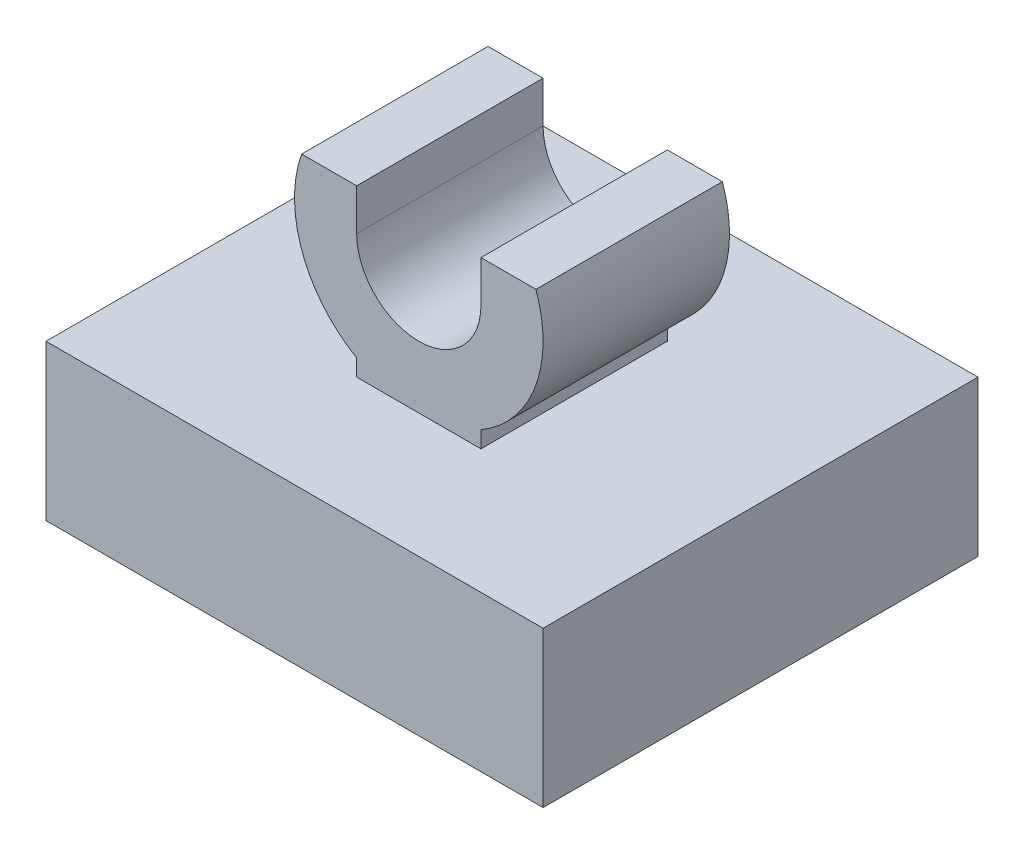
ISO-10303-21;
HEADER;
FILE_DESCRIPTION(('STEP AP214'),'2;1');
FILE_NAME('part.step','',(''),(''),'','','');
FILE_SCHEMA(('AUTOMOTIVE_DESIGN { 1 0 10303 214 1 1 1 1 }'));
ENDSEC;
DATA;
#1=APPLICATION_CONTEXT('core data for automotive mechanical design processes');
#2=APPLICATION_PROTOCOL_DEFINITION('international standard','automotive_design',2000,#1);
#3=PRODUCT_CONTEXT('',#1,'mechanical');
#4=PRODUCT('Part','Part','',(#3));
#5=PRODUCT_RELATED_PRODUCT_CATEGORY('part','',(#4));
#6=PRODUCT_DEFINITION_FORMATION('','',#4);
#7=PRODUCT_DEFINITION_CONTEXT('part definition',#1,'design');
#8=PRODUCT_DEFINITION('design','',#6,#7);
#9=PRODUCT_DEFINITION_SHAPE('','',#8);
#10=(LENGTH_UNIT() NAMED_UNIT(*) SI_UNIT(.MILLI.,.METRE.));
#11=(NAMED_UNIT(*) PLANE_ANGLE_UNIT() SI_UNIT($,.RADIAN.));
#12=(NAMED_UNIT(*) SI_UNIT($,.STERADIAN.) SOLID_ANGLE_UNIT());
#13=UNCERTAINTY_MEASURE_WITH_UNIT(LENGTH_MEASURE(1.E-05),#10,'distance_accuracy_value','');
#14=(GEOMETRIC_REPRESENTATION_CONTEXT(3) GLOBAL_UNCERTAINTY_ASSIGNED_CONTEXT((#13)) GLOBAL_UNIT_ASSIGNED_CONTEXT((#10,
#11,#12)) REPRESENTATION_CONTEXT('',''));
#15=CARTESIAN_POINT('',(0.,0.,0.));
#16=DIRECTION('',(0.,0.,1.));
#17=DIRECTION('',(1.,0.,0.));
#18=AXIS2_PLACEMENT_3D('',#15,#16,#17);
#19=CARTESIAN_POINT('',(-5.08,-3.175,4.445));
#20=DIRECTION('',(1.,0.,0.));
#21=DIRECTION('',(0.,0.,-1.));
#22=AXIS2_PLACEMENT_3D('',#19,#20,#21);
#23=PLANE('',#22);
#24=DIRECTION('',(0.,0.,-1.));
#25=VECTOR('',#24,1.);
#26=CARTESIAN_POINT('',(-5.08,-3.175,4.445));
#27=LINE('',#26,#25);
#28=CARTESIAN_POINT('',(-5.08,-3.175,4.445));
#29=VERTEX_POINT('',#28);
#30=CARTESIAN_POINT('',(-5.08,-3.175,-4.445));
#31=VERTEX_POINT('',#30);
#32=EDGE_CURVE('E12',#29,#31,#27,.T.);
#33=ORIENTED_EDGE('',*,*,#32,.F.);
#34=DIRECTION('',(0.,-1.,0.));
#35=VECTOR('',#34,1.);
#36=CARTESIAN_POINT('',(-5.08,-3.175,4.445));
#37=LINE('',#36,#35);
#38=CARTESIAN_POINT('',(-5.08,0.,4.445));
#39=VERTEX_POINT('',#38);
#40=EDGE_CURVE('E317',#39,#29,#37,.T.);
#41=ORIENTED_EDGE('',*,*,#40,.F.);
#42=DIRECTION('',(0.,0.,-1.));
#43=VECTOR('',#42,1.);
#44=CARTESIAN_POINT('',(-5.08,0.,4.445));
#45=LINE('',#44,#43);
#46=CARTESIAN_POINT('',(-5.08,0.,-4.445));
#47=VERTEX_POINT('',#46);
#48=EDGE_CURVE('E330',#39,#47,#45,.T.);
#49=ORIENTED_EDGE('',*,*,#48,.T.);
#50=DIRECTION('',(0.,-1.,0.));
#51=VECTOR('',#50,1.);
#52=CARTESIAN_POINT('',(-5.08,-3.175,-4.445));
#53=LINE('',#52,#51);
#54=EDGE_CURVE('E316',#47,#31,#53,.T.);
#55=ORIENTED_EDGE('',*,*,#54,.T.);
#56=EDGE_LOOP('',(#33,#41,#49,#55));
#57=FACE_BOUND('',#56,.T.);
#58=ADVANCED_FACE('F39',(#57),#23,.F.);
#59=CARTESIAN_POINT('',(5.08,-3.175,4.445));
#60=DIRECTION('',(0.,1.,0.));
#61=DIRECTION('',(-1.,0.,0.));
#62=AXIS2_PLACEMENT_3D('',#59,#60,#61);
#63=PLANE('',#62);
#64=DIRECTION('',(0.,0.,-1.));
#65=VECTOR('',#64,1.);
#66=CARTESIAN_POINT('',(-2.54,-3.175,2.54));
#67=LINE('',#66,#65);
#68=CARTESIAN_POINT('',(-2.54,-3.175,2.54));
#69=VERTEX_POINT('',#68);
#70=CARTESIAN_POINT('',(-2.54,-3.175,-2.54));
#71=VERTEX_POINT('',#70);
#72=EDGE_CURVE('E202',#69,#71,#67,.T.);
#73=ORIENTED_EDGE('',*,*,#72,.F.);
#74=DIRECTION('',(-1.,0.,0.));
#75=VECTOR('',#74,1.);
#76=CARTESIAN_POINT('',(2.54,-3.175,2.54));
#77=LINE('',#76,#75);
#78=CARTESIAN_POINT('',(2.54,-3.175,2.54));
#79=VERTEX_POINT('',#78);
#80=EDGE_CURVE('E54',#79,#69,#77,.T.);
#81=ORIENTED_EDGE('',*,*,#80,.F.);
#82=DIRECTION('',(0.,0.,1.));
#83=VECTOR('',#82,1.);
#84=CARTESIAN_POINT('',(2.54,-3.175,-2.54));
#85=LINE('',#84,#83);
#86=CARTESIAN_POINT('',(2.54,-3.175,-2.54));
#87=VERTEX_POINT('',#86);
#88=EDGE_CURVE('E188',#87,#79,#85,.T.);
#89=ORIENTED_EDGE('',*,*,#88,.F.);
#90=DIRECTION('',(1.,0.,0.));
#91=VECTOR('',#90,1.);
#92=CARTESIAN_POINT('',(-2.54,-3.175,-2.54));
#93=LINE('',#92,#91);
#94=EDGE_CURVE('E193',#71,#87,#93,.T.);
#95=ORIENTED_EDGE('',*,*,#94,.F.);
#96=EDGE_LOOP('',(#73,#81,#89,#95));
#97=FACE_BOUND('',#96,.T.);
#98=DIRECTION('',(1.,0.,0.));
#99=VECTOR('',#98,1.);
#100=CARTESIAN_POINT('',(5.08,-3.175,-4.445));
#101=LINE('',#100,#99);
#102=CARTESIAN_POINT('',(5.08,-3.175,-4.445));
#103=VERTEX_POINT('',#102);
#104=EDGE_CURVE('E333',#31,#103,#101,.T.);
#105=ORIENTED_EDGE('',*,*,#104,.T.);
#106=DIRECTION('',(0.,0.,-1.));
#107=VECTOR('',#106,1.);
#108=CARTESIAN_POINT('',(5.08,-3.175,4.445));
#109=LINE('',#108,#107);
#110=CARTESIAN_POINT('',(5.08,-3.175,4.445));
#111=VERTEX_POINT('',#110);
#112=EDGE_CURVE('E47',#111,#103,#109,.T.);
#113=ORIENTED_EDGE('',*,*,#112,.F.);
#114=DIRECTION('',(1.,0.,0.));
#115=VECTOR('',#114,1.);
#116=CARTESIAN_POINT('',(5.08,-3.175,4.445));
#117=LINE('',#116,#115);
#118=EDGE_CURVE('E320',#29,#111,#117,.T.);
#119=ORIENTED_EDGE('',*,*,#118,.F.);
#120=ORIENTED_EDGE('',*,*,#32,.T.);
#121=EDGE_LOOP('',(#105,#113,#119,#120));
#122=FACE_BOUND('',#121,.T.);
#123=ADVANCED_FACE('F372',(#97,#122),#63,.F.);
#124=CARTESIAN_POINT('',(5.08,0.,4.445));
#125=DIRECTION('',(-1.,0.,0.));
#126=DIRECTION('',(0.,0.,1.));
#127=AXIS2_PLACEMENT_3D('',#124,#125,#126);
#128=PLANE('',#127);
#129=DIRECTION('',(0.,1.,0.));
#130=VECTOR('',#129,1.);
#131=CARTESIAN_POINT('',(5.08,0.,-4.445));
#132=LINE('',#131,#130);
#133=CARTESIAN_POINT('',(5.08,0.,-4.445));
#134=VERTEX_POINT('',#133);
#135=EDGE_CURVE('E336',#103,#134,#132,.T.);
#136=ORIENTED_EDGE('',*,*,#135,.T.);
#137=DIRECTION('',(0.,0.,-1.));
#138=VECTOR('',#137,1.);
#139=CARTESIAN_POINT('',(5.08,0.,4.445));
#140=LINE('',#139,#138);
#141=CARTESIAN_POINT('',(5.08,0.,4.445));
#142=VERTEX_POINT('',#141);
#143=EDGE_CURVE('E344',#142,#134,#140,.T.);
#144=ORIENTED_EDGE('',*,*,#143,.F.);
#145=DIRECTION('',(0.,1.,0.));
#146=VECTOR('',#145,1.);
#147=CARTESIAN_POINT('',(5.08,0.,4.445));
#148=LINE('',#147,#146);
#149=EDGE_CURVE('E324',#111,#142,#148,.T.);
#150=ORIENTED_EDGE('',*,*,#149,.F.);
#151=ORIENTED_EDGE('',*,*,#112,.T.);
#152=EDGE_LOOP('',(#136,#144,#150,#151));
#153=FACE_BOUND('',#152,.T.);
#154=ADVANCED_FACE('F354',(#153),#128,.F.);
#155=CARTESIAN_POINT('',(-5.08,0.,4.445));
#156=DIRECTION('',(0.,-1.,0.));
#157=DIRECTION('',(0.,0.,-1.));
#158=AXIS2_PLACEMENT_3D('',#155,#156,#157);
#159=PLANE('',#158);
#160=DIRECTION('',(0.,0.,-1.));
#161=VECTOR('',#160,1.);
#162=CARTESIAN_POINT('',(-1.27,0.,1.905));
#163=LINE('',#162,#161);
#164=CARTESIAN_POINT('',(-1.27,0.,1.905));
#165=VERTEX_POINT('',#164);
#166=CARTESIAN_POINT('',(-1.27,0.,-1.905));
#167=VERTEX_POINT('',#166);
#168=EDGE_CURVE('E308',#165,#167,#163,.T.);
#169=ORIENTED_EDGE('',*,*,#168,.T.);
#170=DIRECTION('',(1.,0.,0.));
#171=VECTOR('',#170,1.);
#172=CARTESIAN_POINT('',(-1.27,0.,-1.905));
#173=LINE('',#172,#171);
#174=CARTESIAN_POINT('',(1.27,0.,-1.905));
#175=VERTEX_POINT('',#174);
#176=EDGE_CURVE('E62',#167,#175,#173,.T.);
#177=ORIENTED_EDGE('',*,*,#176,.T.);
#178=DIRECTION('',(0.,0.,-1.));
#179=VECTOR('',#178,1.);
#180=CARTESIAN_POINT('',(1.27,0.,1.905));
#181=LINE('',#180,#179);
#182=CARTESIAN_POINT('',(1.27,0.,1.905));
#183=VERTEX_POINT('',#182);
#184=EDGE_CURVE('E305',#183,#175,#181,.T.);
#185=ORIENTED_EDGE('',*,*,#184,.F.);
#186=DIRECTION('',(1.,0.,0.));
#187=VECTOR('',#186,1.);
#188=CARTESIAN_POINT('',(-1.27,0.,1.905));
#189=LINE('',#188,#187);
#190=EDGE_CURVE('E225',#165,#183,#189,.T.);
#191=ORIENTED_EDGE('',*,*,#190,.F.);
#192=EDGE_LOOP('',(#169,#177,#185,#191));
#193=FACE_BOUND('',#192,.T.);
#194=DIRECTION('',(-1.,0.,0.));
#195=VECTOR('',#194,1.);
#196=CARTESIAN_POINT('',(-5.08,0.,-4.445));
#197=LINE('',#196,#195);
#198=EDGE_CURVE('E321',#134,#47,#197,.T.);
#199=ORIENTED_EDGE('',*,*,#198,.T.);
#200=ORIENTED_EDGE('',*,*,#48,.F.);
#201=DIRECTION('',(-1.,0.,0.));
#202=VECTOR('',#201,1.);
#203=CARTESIAN_POINT('',(-5.08,0.,4.445));
#204=LINE('',#203,#202);
#205=EDGE_CURVE('E327',#142,#39,#204,.T.);
#206=ORIENTED_EDGE('',*,*,#205,.F.);
#207=ORIENTED_EDGE('',*,*,#143,.T.);
#208=EDGE_LOOP('',(#199,#200,#206,#207));
#209=FACE_BOUND('',#208,.T.);
#210=ADVANCED_FACE('F365',(#193,#209),#159,.F.);
#211=CARTESIAN_POINT('',(0.,0.,4.445));
#212=DIRECTION('',(0.,0.,-1.));
#213=DIRECTION('',(-1.,0.,0.));
#214=AXIS2_PLACEMENT_3D('',#211,#212,#213);
#215=PLANE('',#214);
#216=ORIENTED_EDGE('',*,*,#149,.T.);
#217=ORIENTED_EDGE('',*,*,#205,.T.);
#218=ORIENTED_EDGE('',*,*,#40,.T.);
#219=ORIENTED_EDGE('',*,*,#118,.T.);
#220=EDGE_LOOP('',(#216,#217,#218,#219));
#221=FACE_BOUND('',#220,.T.);
#222=ADVANCED_FACE('F371',(#221),#215,.F.);
#223=CARTESIAN_POINT('',(0.,0.,-4.445));
#224=DIRECTION('',(0.,0.,-1.));
#225=DIRECTION('',(-1.,0.,0.));
#226=AXIS2_PLACEMENT_3D('',#223,#224,#225);
#227=PLANE('',#226);
#228=ORIENTED_EDGE('',*,*,#104,.F.);
#229=ORIENTED_EDGE('',*,*,#54,.F.);
#230=ORIENTED_EDGE('',*,*,#198,.F.);
#231=ORIENTED_EDGE('',*,*,#135,.F.);
#232=EDGE_LOOP('',(#228,#229,#230,#231));
#233=FACE_BOUND('',#232,.T.);
#234=ADVANCED_FACE('F361',(#233),#227,.T.);
#235=CARTESIAN_POINT('',(0.,2.54,1.905));
#236=DIRECTION('',(0.,0.,-1.));
#237=DIRECTION('',(-1.,0.,0.));
#238=AXIS2_PLACEMENT_3D('',#235,#236,#237);
#239=CYLINDRICAL_SURFACE('',#238,2.54);
#240=CARTESIAN_POINT('',(0.,2.54,-1.905));
#241=DIRECTION('',(0.,0.,1.));
#242=DIRECTION('',(1.,0.,0.));
#243=AXIS2_PLACEMENT_3D('',#240,#241,#242);
#244=CIRCLE('',#243,2.54);
#245=CARTESIAN_POINT('',(-2.39473496561844,3.38666666666667,-1.905));
#246=VERTEX_POINT('',#245);
#247=CARTESIAN_POINT('',(-1.27,0.340295474387526,-1.905));
#248=VERTEX_POINT('',#247);
#249=EDGE_CURVE('E211',#246,#248,#244,.T.);
#250=ORIENTED_EDGE('',*,*,#249,.T.);
#251=DIRECTION('',(0.,0.,-1.));
#252=VECTOR('',#251,1.);
#253=CARTESIAN_POINT('',(-1.27,0.340295474387526,1.905));
#254=LINE('',#253,#252);
#255=CARTESIAN_POINT('',(-1.27,0.340295474387526,1.905));
#256=VERTEX_POINT('',#255);
#257=EDGE_CURVE('E312',#256,#248,#254,.T.);
#258=ORIENTED_EDGE('',*,*,#257,.F.);
#259=CARTESIAN_POINT('',(0.,2.54,1.905));
#260=DIRECTION('',(0.,0.,1.));
#261=DIRECTION('',(1.,0.,0.));
#262=AXIS2_PLACEMENT_3D('',#259,#260,#261);
#263=CIRCLE('',#262,2.54);
#264=CARTESIAN_POINT('',(-2.39473496561844,3.38666666666667,1.905));
#265=VERTEX_POINT('',#264);
#266=EDGE_CURVE('E217',#265,#256,#263,.T.);
#267=ORIENTED_EDGE('',*,*,#266,.F.);
#268=DIRECTION('',(0.,0.,-1.));
#269=VECTOR('',#268,1.);
#270=CARTESIAN_POINT('',(-2.39473496561844,3.38666666666667,1.905));
#271=LINE('',#270,#269);
#272=EDGE_CURVE('E249',#265,#246,#271,.T.);
#273=ORIENTED_EDGE('',*,*,#272,.T.);
#274=EDGE_LOOP('',(#250,#258,#267,#273));
#275=FACE_BOUND('',#274,.T.);
#276=ADVANCED_FACE('F386',(#275),#239,.T.);
#277=CARTESIAN_POINT('',(-1.27,0.340295474387526,1.905));
#278=DIRECTION('',(1.,0.,0.));
#279=DIRECTION('',(0.,0.,-1.));
#280=AXIS2_PLACEMENT_3D('',#277,#278,#279);
#281=PLANE('',#280);
#282=DIRECTION('',(0.,-1.,0.));
#283=VECTOR('',#282,1.);
#284=CARTESIAN_POINT('',(-1.27,0.340295474387526,-1.905));
#285=LINE('',#284,#283);
#286=EDGE_CURVE('E253',#248,#167,#285,.T.);
#287=ORIENTED_EDGE('',*,*,#286,.T.);
#288=ORIENTED_EDGE('',*,*,#168,.F.);
#289=DIRECTION('',(0.,-1.,0.));
#290=VECTOR('',#289,1.);
#291=CARTESIAN_POINT('',(-1.27,0.340295474387526,1.905));
#292=LINE('',#291,#290);
#293=EDGE_CURVE('E221',#256,#165,#292,.T.);
#294=ORIENTED_EDGE('',*,*,#293,.F.);
#295=ORIENTED_EDGE('',*,*,#257,.T.);
#296=EDGE_LOOP('',(#287,#288,#294,#295));
#297=FACE_BOUND('',#296,.T.);
#298=ADVANCED_FACE('F391',(#297),#281,.F.);
#299=CARTESIAN_POINT('',(1.27,0.340295474387526,1.905));
#300=DIRECTION('',(-1.,0.,0.));
#301=DIRECTION('',(0.,0.,1.));
#302=AXIS2_PLACEMENT_3D('',#299,#300,#301);
#303=PLANE('',#302);
#304=DIRECTION('',(0.,1.,0.));
#305=VECTOR('',#304,1.);
#306=CARTESIAN_POINT('',(1.27,0.340295474387526,-1.905));
#307=LINE('',#306,#305);
#308=CARTESIAN_POINT('',(1.27,0.340295474387526,-1.905));
#309=VERTEX_POINT('',#308);
#310=EDGE_CURVE('E258',#175,#309,#307,.T.);
#311=ORIENTED_EDGE('',*,*,#310,.T.);
#312=DIRECTION('',(0.,0.,-1.));
#313=VECTOR('',#312,1.);
#314=CARTESIAN_POINT('',(1.27,0.340295474387526,1.905));
#315=LINE('',#314,#313);
#316=CARTESIAN_POINT('',(1.27,0.340295474387526,1.905));
#317=VERTEX_POINT('',#316);
#318=EDGE_CURVE('E301',#317,#309,#315,.T.);
#319=ORIENTED_EDGE('',*,*,#318,.F.);
#320=DIRECTION('',(0.,1.,0.));
#321=VECTOR('',#320,1.);
#322=CARTESIAN_POINT('',(1.27,0.340295474387526,1.905));
#323=LINE('',#322,#321);
#324=EDGE_CURVE('E228',#183,#317,#323,.T.);
#325=ORIENTED_EDGE('',*,*,#324,.F.);
#326=ORIENTED_EDGE('',*,*,#184,.T.);
#327=EDGE_LOOP('',(#311,#319,#325,#326));
#328=FACE_BOUND('',#327,.T.);
#329=ADVANCED_FACE('F395',(#328),#303,.F.);
#330=CARTESIAN_POINT('',(0.,2.54,1.905));
#331=DIRECTION('',(0.,0.,-1.));
#332=DIRECTION('',(-1.,0.,0.));
#333=AXIS2_PLACEMENT_3D('',#330,#331,#332);
#334=CYLINDRICAL_SURFACE('',#333,2.54);
#335=CARTESIAN_POINT('',(0.,2.54,-1.905));
#336=DIRECTION('',(0.,0.,1.));
#337=DIRECTION('',(1.,0.,0.));
#338=AXIS2_PLACEMENT_3D('',#335,#336,#337);
#339=CIRCLE('',#338,2.54);
#340=CARTESIAN_POINT('',(2.39473496561844,3.38666666666667,-1.905));
#341=VERTEX_POINT('',#340);
#342=EDGE_CURVE('E261',#309,#341,#339,.T.);
#343=ORIENTED_EDGE('',*,*,#342,.T.);
#344=DIRECTION('',(0.,0.,-1.));
#345=VECTOR('',#344,1.);
#346=CARTESIAN_POINT('',(2.39473496561844,3.38666666666667,1.905));
#347=LINE('',#346,#345);
#348=CARTESIAN_POINT('',(2.39473496561844,3.38666666666667,1.905));
#349=VERTEX_POINT('',#348);
#350=EDGE_CURVE('E297',#349,#341,#347,.T.);
#351=ORIENTED_EDGE('',*,*,#350,.F.);
#352=CARTESIAN_POINT('',(0.,2.54,1.905));
#353=DIRECTION('',(0.,0.,1.));
#354=DIRECTION('',(1.,0.,0.));
#355=AXIS2_PLACEMENT_3D('',#352,#353,#354);
#356=CIRCLE('',#355,2.54);
#357=EDGE_CURVE('E231',#317,#349,#356,.T.);
#358=ORIENTED_EDGE('',*,*,#357,.F.);
#359=ORIENTED_EDGE('',*,*,#318,.T.);
#360=EDGE_LOOP('',(#343,#351,#358,#359));
#361=FACE_BOUND('',#360,.T.);
#362=ADVANCED_FACE('F399',(#361),#334,.T.);
#363=CARTESIAN_POINT('',(1.27,3.38666666666667,1.905));
#364=DIRECTION('',(0.,-1.,0.));
#365=DIRECTION('',(1.,0.,0.));
#366=AXIS2_PLACEMENT_3D('',#363,#364,#365);
#367=PLANE('',#366);
#368=DIRECTION('',(-1.,0.,0.));
#369=VECTOR('',#368,1.);
#370=CARTESIAN_POINT('',(1.27,3.38666666666667,-1.905));
#371=LINE('',#370,#369);
#372=CARTESIAN_POINT('',(1.27,3.38666666666667,-1.905));
#373=VERTEX_POINT('',#372);
#374=EDGE_CURVE('E264',#341,#373,#371,.T.);
#375=ORIENTED_EDGE('',*,*,#374,.T.);
#376=DIRECTION('',(0.,0.,-1.));
#377=VECTOR('',#376,1.);
#378=CARTESIAN_POINT('',(1.27,3.38666666666667,1.905));
#379=LINE('',#378,#377);
#380=CARTESIAN_POINT('',(1.27,3.38666666666667,1.905));
#381=VERTEX_POINT('',#380);
#382=EDGE_CURVE('E293',#381,#373,#379,.T.);
#383=ORIENTED_EDGE('',*,*,#382,.F.);
#384=DIRECTION('',(-1.,0.,0.));
#385=VECTOR('',#384,1.);
#386=CARTESIAN_POINT('',(1.27,3.38666666666667,1.905));
#387=LINE('',#386,#385);
#388=EDGE_CURVE('E234',#349,#381,#387,.T.);
#389=ORIENTED_EDGE('',*,*,#388,.F.);
#390=ORIENTED_EDGE('',*,*,#350,.T.);
#391=EDGE_LOOP('',(#375,#383,#389,#390));
#392=FACE_BOUND('',#391,.T.);
#393=ADVANCED_FACE('F403',(#392),#367,.F.);
#394=CARTESIAN_POINT('',(1.27,2.54,1.905));
#395=DIRECTION('',(1.,0.,0.));
#396=DIRECTION('',(0.,1.,0.));
#397=AXIS2_PLACEMENT_3D('',#394,#395,#396);
#398=PLANE('',#397);
#399=DIRECTION('',(0.,-1.,0.));
#400=VECTOR('',#399,1.);
#401=CARTESIAN_POINT('',(1.27,2.54,-1.905));
#402=LINE('',#401,#400);
#403=CARTESIAN_POINT('',(1.27,2.54,-1.905));
#404=VERTEX_POINT('',#403);
#405=EDGE_CURVE('E267',#373,#404,#402,.T.);
#406=ORIENTED_EDGE('',*,*,#405,.T.);
#407=DIRECTION('',(0.,0.,-1.));
#408=VECTOR('',#407,1.);
#409=CARTESIAN_POINT('',(1.27,2.54,1.905));
#410=LINE('',#409,#408);
#411=CARTESIAN_POINT('',(1.27,2.54,1.905));
#412=VERTEX_POINT('',#411);
#413=EDGE_CURVE('E289',#412,#404,#410,.T.);
#414=ORIENTED_EDGE('',*,*,#413,.F.);
#415=DIRECTION('',(0.,-1.,0.));
#416=VECTOR('',#415,1.);
#417=CARTESIAN_POINT('',(1.27,2.54,1.905));
#418=LINE('',#417,#416);
#419=EDGE_CURVE('E237',#381,#412,#418,.T.);
#420=ORIENTED_EDGE('',*,*,#419,.F.);
#421=ORIENTED_EDGE('',*,*,#382,.T.);
#422=EDGE_LOOP('',(#406,#414,#420,#421));
#423=FACE_BOUND('',#422,.T.);
#424=ADVANCED_FACE('F407',(#423),#398,.F.);
#425=CARTESIAN_POINT('',(0.,2.54,1.905));
#426=DIRECTION('',(0.,0.,-1.));
#427=DIRECTION('',(-1.,0.,0.));
#428=AXIS2_PLACEMENT_3D('',#425,#426,#427);
#429=CYLINDRICAL_SURFACE('',#428,1.27);
#430=CARTESIAN_POINT('',(0.,2.54,-1.905));
#431=DIRECTION('',(0.,0.,-1.));
#432=DIRECTION('',(1.,0.,0.));
#433=AXIS2_PLACEMENT_3D('',#430,#431,#432);
#434=CIRCLE('',#433,1.27);
#435=CARTESIAN_POINT('',(-1.27,2.54,-1.905));
#436=VERTEX_POINT('',#435);
#437=EDGE_CURVE('E270',#404,#436,#434,.T.);
#438=ORIENTED_EDGE('',*,*,#437,.T.);
#439=DIRECTION('',(0.,0.,-1.));
#440=VECTOR('',#439,1.);
#441=CARTESIAN_POINT('',(-1.27,2.54,1.905));
#442=LINE('',#441,#440);
#443=CARTESIAN_POINT('',(-1.27,2.54,1.905));
#444=VERTEX_POINT('',#443);
#445=EDGE_CURVE('E285',#444,#436,#442,.T.);
#446=ORIENTED_EDGE('',*,*,#445,.F.);
#447=CARTESIAN_POINT('',(0.,2.54,1.905));
#448=DIRECTION('',(0.,0.,-1.));
#449=DIRECTION('',(1.,0.,0.));
#450=AXIS2_PLACEMENT_3D('',#447,#448,#449);
#451=CIRCLE('',#450,1.27);
#452=EDGE_CURVE('E240',#412,#444,#451,.T.);
#453=ORIENTED_EDGE('',*,*,#452,.F.);
#454=ORIENTED_EDGE('',*,*,#413,.T.);
#455=EDGE_LOOP('',(#438,#446,#453,#454));
#456=FACE_BOUND('',#455,.T.);
#457=ADVANCED_FACE('F411',(#456),#429,.F.);
#458=CARTESIAN_POINT('',(-1.27,2.54,1.905));
#459=DIRECTION('',(-1.,0.,0.));
#460=DIRECTION('',(0.,0.,1.));
#461=AXIS2_PLACEMENT_3D('',#458,#459,#460);
#462=PLANE('',#461);
#463=DIRECTION('',(0.,1.,0.));
#464=VECTOR('',#463,1.);
#465=CARTESIAN_POINT('',(-1.27,2.54,-1.905));
#466=LINE('',#465,#464);
#467=CARTESIAN_POINT('',(-1.27,3.38666666666667,-1.905));
#468=VERTEX_POINT('',#467);
#469=EDGE_CURVE('E273',#436,#468,#466,.T.);
#470=ORIENTED_EDGE('',*,*,#469,.T.);
#471=DIRECTION('',(0.,0.,-1.));
#472=VECTOR('',#471,1.);
#473=CARTESIAN_POINT('',(-1.27,3.38666666666667,1.905));
#474=LINE('',#473,#472);
#475=CARTESIAN_POINT('',(-1.27,3.38666666666667,1.905));
#476=VERTEX_POINT('',#475);
#477=EDGE_CURVE('E281',#476,#468,#474,.T.);
#478=ORIENTED_EDGE('',*,*,#477,.F.);
#479=DIRECTION('',(0.,1.,0.));
#480=VECTOR('',#479,1.);
#481=CARTESIAN_POINT('',(-1.27,2.54,1.905));
#482=LINE('',#481,#480);
#483=EDGE_CURVE('E243',#444,#476,#482,.T.);
#484=ORIENTED_EDGE('',*,*,#483,.F.);
#485=ORIENTED_EDGE('',*,*,#445,.T.);
#486=EDGE_LOOP('',(#470,#478,#484,#485));
#487=FACE_BOUND('',#486,.T.);
#488=ADVANCED_FACE('F415',(#487),#462,.F.);
#489=CARTESIAN_POINT('',(-2.39473496561844,3.38666666666667,1.905));
#490=DIRECTION('',(0.,-1.,0.));
#491=DIRECTION('',(1.,0.,0.));
#492=AXIS2_PLACEMENT_3D('',#489,#490,#491);
#493=PLANE('',#492);
#494=DIRECTION('',(-1.,0.,0.));
#495=VECTOR('',#494,1.);
#496=CARTESIAN_POINT('',(-2.39473496561844,3.38666666666667,-1.905));
#497=LINE('',#496,#495);
#498=EDGE_CURVE('E222',#468,#246,#497,.T.);
#499=ORIENTED_EDGE('',*,*,#498,.T.);
#500=ORIENTED_EDGE('',*,*,#272,.F.);
#501=DIRECTION('',(-1.,0.,0.));
#502=VECTOR('',#501,1.);
#503=CARTESIAN_POINT('',(-2.39473496561844,3.38666666666667,1.905));
#504=LINE('',#503,#502);
#505=EDGE_CURVE('E246',#476,#265,#504,.T.);
#506=ORIENTED_EDGE('',*,*,#505,.F.);
#507=ORIENTED_EDGE('',*,*,#477,.T.);
#508=EDGE_LOOP('',(#499,#500,#506,#507));
#509=FACE_BOUND('',#508,.T.);
#510=ADVANCED_FACE('F419',(#509),#493,.F.);
#511=CARTESIAN_POINT('',(0.,2.54,1.905));
#512=DIRECTION('',(0.,0.,1.));
#513=DIRECTION('',(1.,0.,0.));
#514=AXIS2_PLACEMENT_3D('',#511,#512,#513);
#515=PLANE('',#514);
#516=ORIENTED_EDGE('',*,*,#266,.T.);
#517=ORIENTED_EDGE('',*,*,#293,.T.);
#518=ORIENTED_EDGE('',*,*,#190,.T.);
#519=ORIENTED_EDGE('',*,*,#324,.T.);
#520=ORIENTED_EDGE('',*,*,#357,.T.);
#521=ORIENTED_EDGE('',*,*,#388,.T.);
#522=ORIENTED_EDGE('',*,*,#419,.T.);
#523=ORIENTED_EDGE('',*,*,#452,.T.);
#524=ORIENTED_EDGE('',*,*,#483,.T.);
#525=ORIENTED_EDGE('',*,*,#505,.T.);
#526=EDGE_LOOP('',(#516,#517,#518,#519,#520,#521,#522,#523,#524,#525));
#527=FACE_BOUND('',#526,.T.);
#528=ADVANCED_FACE('F423',(#527),#515,.T.);
#529=CARTESIAN_POINT('',(0.,2.54,-1.905));
#530=DIRECTION('',(0.,0.,1.));
#531=DIRECTION('',(1.,0.,0.));
#532=AXIS2_PLACEMENT_3D('',#529,#530,#531);
#533=PLANE('',#532);
#534=ORIENTED_EDGE('',*,*,#249,.F.);
#535=ORIENTED_EDGE('',*,*,#498,.F.);
#536=ORIENTED_EDGE('',*,*,#469,.F.);
#537=ORIENTED_EDGE('',*,*,#437,.F.);
#538=ORIENTED_EDGE('',*,*,#405,.F.);
#539=ORIENTED_EDGE('',*,*,#374,.F.);
#540=ORIENTED_EDGE('',*,*,#342,.F.);
#541=ORIENTED_EDGE('',*,*,#310,.F.);
#542=ORIENTED_EDGE('',*,*,#176,.F.);
#543=ORIENTED_EDGE('',*,*,#286,.F.);
#544=EDGE_LOOP('',(#534,#535,#536,#537,#538,#539,#540,#541,#542,#543));
#545=FACE_BOUND('',#544,.T.);
#546=ADVANCED_FACE('F425',(#545),#533,.F.);
#547=CARTESIAN_POINT('',(2.54,-1.27,2.54));
#548=DIRECTION('',(0.,0.,1.));
#549=DIRECTION('',(1.,0.,0.));
#550=AXIS2_PLACEMENT_3D('',#547,#548,#549);
#551=PLANE('',#550);
#552=ORIENTED_EDGE('',*,*,#80,.T.);
#553=DIRECTION('',(0.,-1.,0.));
#554=VECTOR('',#553,1.);
#555=CARTESIAN_POINT('',(-2.54,-1.27,2.54));
#556=LINE('',#555,#554);
#557=CARTESIAN_POINT('',(-2.54,-1.27,2.54));
#558=VERTEX_POINT('',#557);
#559=EDGE_CURVE('E163',#558,#69,#556,.T.);
#560=ORIENTED_EDGE('',*,*,#559,.F.);
#561=DIRECTION('',(-1.,0.,0.));
#562=VECTOR('',#561,1.);
#563=CARTESIAN_POINT('',(2.54,-1.27,2.54));
#564=LINE('',#563,#562);
#565=CARTESIAN_POINT('',(2.54,-1.27,2.54));
#566=VERTEX_POINT('',#565);
#567=EDGE_CURVE('E167',#566,#558,#564,.T.);
#568=ORIENTED_EDGE('',*,*,#567,.F.);
#569=DIRECTION('',(0.,-1.,0.));
#570=VECTOR('',#569,1.);
#571=CARTESIAN_POINT('',(2.54,-1.27,2.54));
#572=LINE('',#571,#570);
#573=EDGE_CURVE('E208',#566,#79,#572,.T.);
#574=ORIENTED_EDGE('',*,*,#573,.T.);
#575=EDGE_LOOP('',(#552,#560,#568,#574));
#576=FACE_BOUND('',#575,.T.);
#577=ADVANCED_FACE('F165',(#576),#551,.F.);
#578=CARTESIAN_POINT('',(2.54,-1.27,-2.54));
#579=DIRECTION('',(1.,0.,0.));
#580=DIRECTION('',(0.,1.,0.));
#581=AXIS2_PLACEMENT_3D('',#578,#579,#580);
#582=PLANE('',#581);
#583=ORIENTED_EDGE('',*,*,#88,.T.);
#584=ORIENTED_EDGE('',*,*,#573,.F.);
#585=DIRECTION('',(0.,0.,1.));
#586=VECTOR('',#585,1.);
#587=CARTESIAN_POINT('',(2.54,-1.27,-2.54));
#588=LINE('',#587,#586);
#589=CARTESIAN_POINT('',(2.54,-1.27,-2.54));
#590=VERTEX_POINT('',#589);
#591=EDGE_CURVE('E174',#590,#566,#588,.T.);
#592=ORIENTED_EDGE('',*,*,#591,.F.);
#593=DIRECTION('',(0.,-1.,0.));
#594=VECTOR('',#593,1.);
#595=CARTESIAN_POINT('',(2.54,-1.27,-2.54));
#596=LINE('',#595,#594);
#597=EDGE_CURVE('E212',#590,#87,#596,.T.);
#598=ORIENTED_EDGE('',*,*,#597,.T.);
#599=EDGE_LOOP('',(#583,#584,#592,#598));
#600=FACE_BOUND('',#599,.T.);
#601=ADVANCED_FACE('F433',(#600),#582,.F.);
#602=CARTESIAN_POINT('',(-2.54,-1.27,-2.54));
#603=DIRECTION('',(0.,0.,-1.));
#604=DIRECTION('',(-1.,0.,0.));
#605=AXIS2_PLACEMENT_3D('',#602,#603,#604);
#606=PLANE('',#605);
#607=ORIENTED_EDGE('',*,*,#94,.T.);
#608=ORIENTED_EDGE('',*,*,#597,.F.);
#609=DIRECTION('',(1.,0.,0.));
#610=VECTOR('',#609,1.);
#611=CARTESIAN_POINT('',(-2.54,-1.27,-2.54));
#612=LINE('',#611,#610);
#613=CARTESIAN_POINT('',(-2.54,-1.27,-2.54));
#614=VERTEX_POINT('',#613);
#615=EDGE_CURVE('E183',#614,#590,#612,.T.);
#616=ORIENTED_EDGE('',*,*,#615,.F.);
#617=DIRECTION('',(0.,-1.,0.));
#618=VECTOR('',#617,1.);
#619=CARTESIAN_POINT('',(-2.54,-1.27,-2.54));
#620=LINE('',#619,#618);
#621=EDGE_CURVE('E173',#614,#71,#620,.T.);
#622=ORIENTED_EDGE('',*,*,#621,.T.);
#623=EDGE_LOOP('',(#607,#608,#616,#622));
#624=FACE_BOUND('',#623,.T.);
#625=ADVANCED_FACE('F436',(#624),#606,.F.);
#626=CARTESIAN_POINT('',(-2.54,-1.27,2.54));
#627=DIRECTION('',(-1.,0.,0.));
#628=DIRECTION('',(0.,-1.,0.));
#629=AXIS2_PLACEMENT_3D('',#626,#627,#628);
#630=PLANE('',#629);
#631=ORIENTED_EDGE('',*,*,#72,.T.);
#632=ORIENTED_EDGE('',*,*,#621,.F.);
#633=DIRECTION('',(0.,0.,-1.));
#634=VECTOR('',#633,1.);
#635=CARTESIAN_POINT('',(-2.54,-1.27,2.54));
#636=LINE('',#635,#634);
#637=EDGE_CURVE('E177',#558,#614,#636,.T.);
#638=ORIENTED_EDGE('',*,*,#637,.F.);
#639=ORIENTED_EDGE('',*,*,#559,.T.);
#640=EDGE_LOOP('',(#631,#632,#638,#639));
#641=FACE_BOUND('',#640,.T.);
#642=ADVANCED_FACE('F178',(#641),#630,.F.);
#643=CARTESIAN_POINT('',(0.,-1.27,0.));
#644=DIRECTION('',(0.,-1.,0.));
#645=DIRECTION('',(1.,0.,0.));
#646=AXIS2_PLACEMENT_3D('',#643,#644,#645);
#647=PLANE('',#646);
#648=ORIENTED_EDGE('',*,*,#567,.T.);
#649=ORIENTED_EDGE('',*,*,#637,.T.);
#650=ORIENTED_EDGE('',*,*,#615,.T.);
#651=ORIENTED_EDGE('',*,*,#591,.T.);
#652=EDGE_LOOP('',(#648,#649,#650,#651));
#653=FACE_BOUND('',#652,.T.);
#654=ADVANCED_FACE('F185',(#653),#647,.T.);
#655=CLOSED_SHELL('',(#58,#123,#154,#210,#222,#234,#276,#298,#329,#362,#393,#424,#457,#488,#510,
#528,#546,#577,#601,#625,#642,#654));
#656=MANIFOLD_SOLID_BREP('B2',#655);
#657=ADVANCED_BREP_SHAPE_REPRESENTATION('',(#18,#656),#14);
#658=SHAPE_DEFINITION_REPRESENTATION(#9,#657);
ENDSEC;
END-ISO-10303-21;
